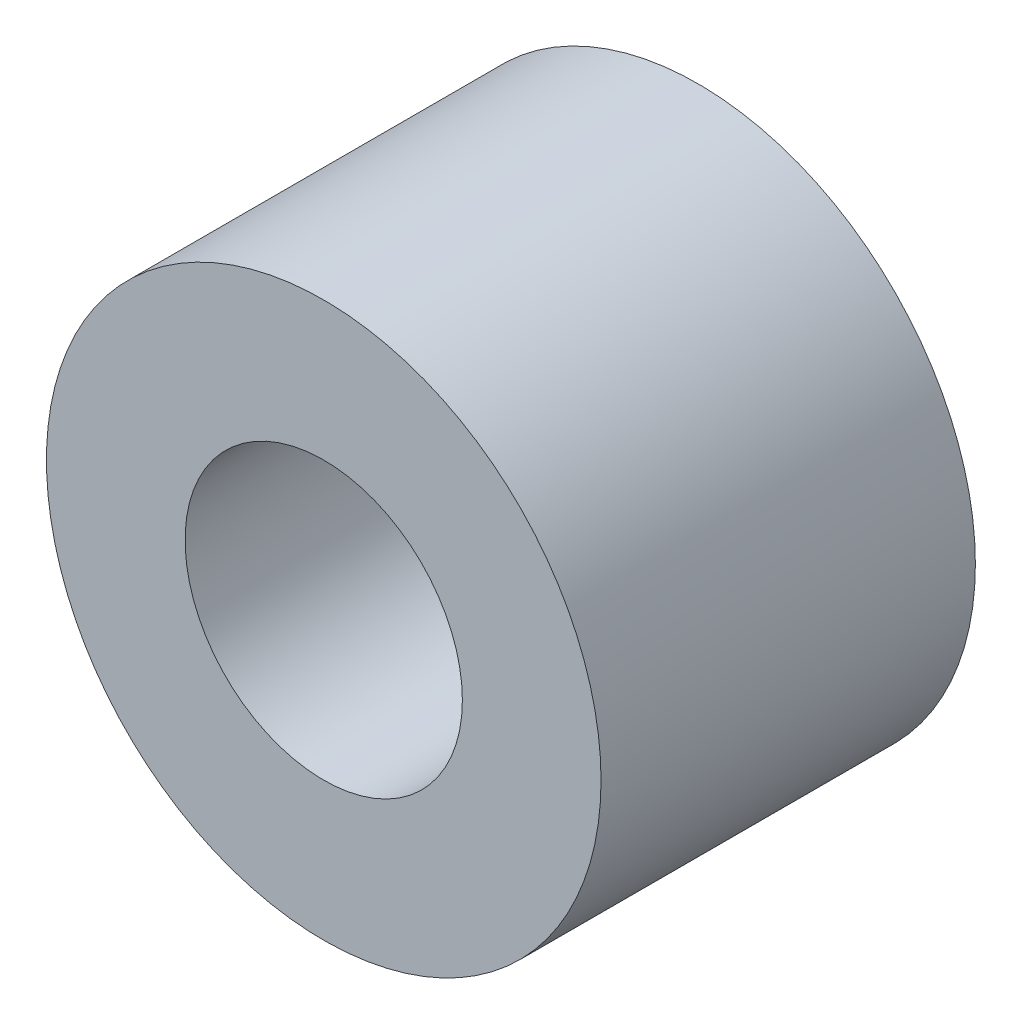
ISO-10303-21;
HEADER;
FILE_DESCRIPTION(('STEP AP214'),'2;1');
FILE_NAME('part.step','',(''),(''),'','','');
FILE_SCHEMA(('AUTOMOTIVE_DESIGN { 1 0 10303 214 1 1 1 1 }'));
ENDSEC;
DATA;
#1=APPLICATION_CONTEXT('core data for automotive mechanical design processes');
#2=APPLICATION_PROTOCOL_DEFINITION('international standard','automotive_design',2000,#1);
#3=PRODUCT_CONTEXT('',#1,'mechanical');
#4=PRODUCT('Part','Part','',(#3));
#5=PRODUCT_RELATED_PRODUCT_CATEGORY('part','',(#4));
#6=PRODUCT_DEFINITION_FORMATION('','',#4);
#7=PRODUCT_DEFINITION_CONTEXT('part definition',#1,'design');
#8=PRODUCT_DEFINITION('design','',#6,#7);
#9=PRODUCT_DEFINITION_SHAPE('','',#8);
#10=(LENGTH_UNIT() NAMED_UNIT(*) SI_UNIT(.MILLI.,.METRE.));
#11=(NAMED_UNIT(*) PLANE_ANGLE_UNIT() SI_UNIT($,.RADIAN.));
#12=(NAMED_UNIT(*) SI_UNIT($,.STERADIAN.) SOLID_ANGLE_UNIT());
#13=UNCERTAINTY_MEASURE_WITH_UNIT(LENGTH_MEASURE(1.E-05),#10,'distance_accuracy_value','');
#14=(GEOMETRIC_REPRESENTATION_CONTEXT(3) GLOBAL_UNCERTAINTY_ASSIGNED_CONTEXT((#13)) GLOBAL_UNIT_ASSIGNED_CONTEXT((#10,
#11,#12)) REPRESENTATION_CONTEXT('',''));
#15=CARTESIAN_POINT('',(0.,0.,0.));
#16=DIRECTION('',(0.,0.,1.));
#17=DIRECTION('',(1.,0.,0.));
#18=AXIS2_PLACEMENT_3D('',#15,#16,#17);
#19=CARTESIAN_POINT('',(0.,0.,2.7));
#20=DIRECTION('',(0.,0.,1.));
#21=DIRECTION('',(1.,0.,0.));
#22=AXIS2_PLACEMENT_3D('',#19,#20,#21);
#23=PLANE('',#22);
#24=CARTESIAN_POINT('',(0.,0.,2.7));
#25=DIRECTION('',(0.,0.,1.));
#26=DIRECTION('',(1.,0.,0.));
#27=AXIS2_PLACEMENT_3D('',#24,#25,#26);
#28=CIRCLE('',#27,2.);
#29=CARTESIAN_POINT('',(2.,0.,2.7));
#30=VERTEX_POINT('',#29);
#31=EDGE_CURVE('E10',#30,#30,#28,.T.);
#32=ORIENTED_EDGE('',*,*,#31,.T.);
#33=EDGE_LOOP('',(#32));
#34=FACE_BOUND('',#33,.T.);
#35=CARTESIAN_POINT('',(0.,0.,2.7));
#36=DIRECTION('',(0.,0.,1.));
#37=DIRECTION('',(1.,0.,0.));
#38=AXIS2_PLACEMENT_3D('',#35,#36,#37);
#39=CIRCLE('',#38,1.);
#40=CARTESIAN_POINT('',(1.,0.,2.7));
#41=VERTEX_POINT('',#40);
#42=EDGE_CURVE('E42',#41,#41,#39,.T.);
#43=ORIENTED_EDGE('',*,*,#42,.F.);
#44=EDGE_LOOP('',(#43));
#45=FACE_BOUND('',#44,.T.);
#46=ADVANCED_FACE('F31',(#34,#45),#23,.T.);
#47=CARTESIAN_POINT('',(0.,0.,0.));
#48=DIRECTION('',(0.,0.,1.));
#49=DIRECTION('',(1.,0.,0.));
#50=AXIS2_PLACEMENT_3D('',#47,#48,#49);
#51=PLANE('',#50);
#52=CARTESIAN_POINT('',(0.,0.,0.));
#53=DIRECTION('',(0.,0.,1.));
#54=DIRECTION('',(1.,0.,0.));
#55=AXIS2_PLACEMENT_3D('',#52,#53,#54);
#56=CIRCLE('',#55,2.);
#57=CARTESIAN_POINT('',(2.,0.,0.));
#58=VERTEX_POINT('',#57);
#59=EDGE_CURVE('E35',#58,#58,#56,.T.);
#60=ORIENTED_EDGE('',*,*,#59,.F.);
#61=EDGE_LOOP('',(#60));
#62=FACE_BOUND('',#61,.T.);
#63=CARTESIAN_POINT('',(0.,0.,0.));
#64=DIRECTION('',(0.,0.,1.));
#65=DIRECTION('',(1.,0.,0.));
#66=AXIS2_PLACEMENT_3D('',#63,#64,#65);
#67=CIRCLE('',#66,1.);
#68=CARTESIAN_POINT('',(1.,0.,0.));
#69=VERTEX_POINT('',#68);
#70=EDGE_CURVE('E44',#69,#69,#67,.T.);
#71=ORIENTED_EDGE('',*,*,#70,.T.);
#72=EDGE_LOOP('',(#71));
#73=FACE_BOUND('',#72,.T.);
#74=ADVANCED_FACE('F54',(#62,#73),#51,.F.);
#75=CARTESIAN_POINT('',(0.,0.,2.7));
#76=DIRECTION('',(0.,0.,-1.));
#77=DIRECTION('',(-1.,0.,0.));
#78=AXIS2_PLACEMENT_3D('',#75,#76,#77);
#79=CYLINDRICAL_SURFACE('',#78,2.);
#80=ORIENTED_EDGE('',*,*,#31,.F.);
#81=EDGE_LOOP('',(#80));
#82=FACE_BOUND('',#81,.T.);
#83=ORIENTED_EDGE('',*,*,#59,.T.);
#84=EDGE_LOOP('',(#83));
#85=FACE_BOUND('',#84,.T.);
#86=ADVANCED_FACE('F33',(#82,#85),#79,.T.);
#87=CARTESIAN_POINT('',(0.,0.,2.7));
#88=DIRECTION('',(0.,0.,-1.));
#89=DIRECTION('',(-1.,0.,0.));
#90=AXIS2_PLACEMENT_3D('',#87,#88,#89);
#91=CYLINDRICAL_SURFACE('',#90,1.);
#92=ORIENTED_EDGE('',*,*,#42,.T.);
#93=EDGE_LOOP('',(#92));
#94=FACE_BOUND('',#93,.T.);
#95=ORIENTED_EDGE('',*,*,#70,.F.);
#96=EDGE_LOOP('',(#95));
#97=FACE_BOUND('',#96,.T.);
#98=ADVANCED_FACE('F50',(#94,#97),#91,.F.);
#99=CLOSED_SHELL('',(#46,#74,#86,#98));
#100=MANIFOLD_SOLID_BREP('B2',#99);
#101=ADVANCED_BREP_SHAPE_REPRESENTATION('',(#18,#100),#14);
#102=SHAPE_DEFINITION_REPRESENTATION(#9,#101);
ENDSEC;
END-ISO-10303-21;
